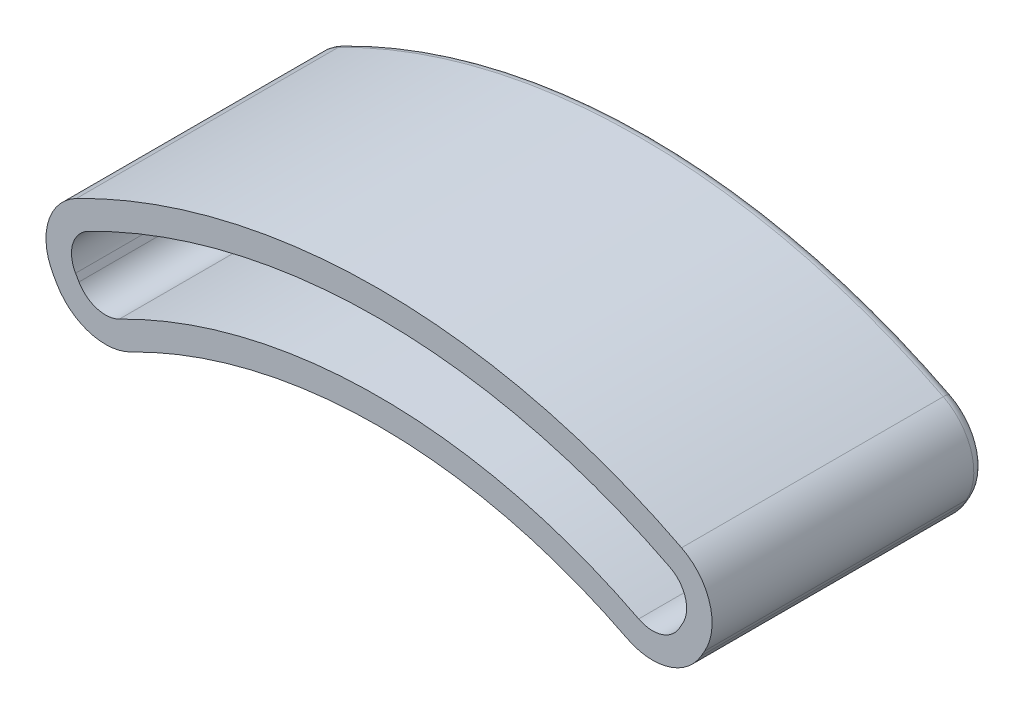
ISO-10303-21;
HEADER;
FILE_DESCRIPTION(('STEP AP214'),'2;1');
FILE_NAME('part.step','',(''),(''),'','','');
FILE_SCHEMA(('AUTOMOTIVE_DESIGN { 1 0 10303 214 1 1 1 1 }'));
ENDSEC;
DATA;
#1=APPLICATION_CONTEXT('core data for automotive mechanical design processes');
#2=APPLICATION_PROTOCOL_DEFINITION('international standard','automotive_design',2000,#1);
#3=PRODUCT_CONTEXT('',#1,'mechanical');
#4=PRODUCT('Part','Part','',(#3));
#5=PRODUCT_RELATED_PRODUCT_CATEGORY('part','',(#4));
#6=PRODUCT_DEFINITION_FORMATION('','',#4);
#7=PRODUCT_DEFINITION_CONTEXT('part definition',#1,'design');
#8=PRODUCT_DEFINITION('design','',#6,#7);
#9=PRODUCT_DEFINITION_SHAPE('','',#8);
#10=(LENGTH_UNIT() NAMED_UNIT(*) SI_UNIT(.MILLI.,.METRE.));
#11=(NAMED_UNIT(*) PLANE_ANGLE_UNIT() SI_UNIT($,.RADIAN.));
#12=(NAMED_UNIT(*) SI_UNIT($,.STERADIAN.) SOLID_ANGLE_UNIT());
#13=UNCERTAINTY_MEASURE_WITH_UNIT(LENGTH_MEASURE(1.E-05),#10,'distance_accuracy_value','');
#14=(GEOMETRIC_REPRESENTATION_CONTEXT(3) GLOBAL_UNCERTAINTY_ASSIGNED_CONTEXT((#13)) GLOBAL_UNIT_ASSIGNED_CONTEXT((#10,
#11,#12)) REPRESENTATION_CONTEXT('',''));
#15=CARTESIAN_POINT('',(0.,0.,0.));
#16=DIRECTION('',(0.,0.,1.));
#17=DIRECTION('',(1.,0.,0.));
#18=AXIS2_PLACEMENT_3D('',#15,#16,#17);
#19=CARTESIAN_POINT('',(-20.4441540822175,39.9823135881673,20.32));
#20=DIRECTION('',(0.,0.,1.));
#21=DIRECTION('',(1.,0.,0.));
#22=AXIS2_PLACEMENT_3D('',#19,#20,#21);
#23=PLANE('',#22);
#24=CARTESIAN_POINT('',(-20.4441540822175,39.9823135881673,20.32));
#25=DIRECTION('',(0.,0.,1.));
#26=DIRECTION('',(1.,0.,0.));
#27=AXIS2_PLACEMENT_3D('',#24,#25,#26);
#28=CIRCLE('',#27,4.191);
#29=CARTESIAN_POINT('',(-24.0736665494781,37.8868135881673,20.32));
#30=VERTEX_POINT('',#29);
#31=CARTESIAN_POINT('',(-18.536136228065,36.2508328005663,20.32));
#32=VERTEX_POINT('',#31);
#33=EDGE_CURVE('E271',#30,#32,#28,.T.);
#34=ORIENTED_EDGE('',*,*,#33,.T.);
#35=CARTESIAN_POINT('',(0.,0.,20.32));
#36=DIRECTION('',(0.,0.,1.));
#37=DIRECTION('',(1.,0.,0.));
#38=AXIS2_PLACEMENT_3D('',#35,#36,#37);
#39=CIRCLE('',#38,40.715);
#40=CARTESIAN_POINT('',(18.536136228065,36.2508328005663,20.32));
#41=VERTEX_POINT('',#40);
#42=EDGE_CURVE('E310',#32,#41,#39,.F.);
#43=ORIENTED_EDGE('',*,*,#42,.T.);
#44=CARTESIAN_POINT('',(20.4441540822175,39.9823135881673,20.32));
#45=DIRECTION('',(0.,0.,1.));
#46=DIRECTION('',(1.,0.,0.));
#47=AXIS2_PLACEMENT_3D('',#44,#45,#46);
#48=CIRCLE('',#47,4.191);
#49=CARTESIAN_POINT('',(24.0736665494781,37.8868135881673,20.32));
#50=VERTEX_POINT('',#49);
#51=EDGE_CURVE('E312',#41,#50,#48,.T.);
#52=ORIENTED_EDGE('',*,*,#51,.T.);
#53=DIRECTION('',(0.499999999999999,0.866025403784439,0.));
#54=VECTOR('',#53,1.);
#55=CARTESIAN_POINT('',(24.0736665494781,37.8868135881673,20.32));
#56=LINE('',#55,#54);
#57=CARTESIAN_POINT('',(24.3279926096189,38.3273192460199,20.32));
#58=VERTEX_POINT('',#57);
#59=EDGE_CURVE('E314',#50,#58,#56,.T.);
#60=ORIENTED_EDGE('',*,*,#59,.T.);
#61=CARTESIAN_POINT('',(20.6984801423583,40.4228192460199,20.32));
#62=DIRECTION('',(0.,0.,1.));
#63=DIRECTION('',(1.,0.,0.));
#64=AXIS2_PLACEMENT_3D('',#61,#62,#63);
#65=CIRCLE('',#64,4.191);
#66=CARTESIAN_POINT('',(22.6086252578871,44.1532115360642,20.32));
#67=VERTEX_POINT('',#66);
#68=EDGE_CURVE('E316',#58,#67,#65,.T.);
#69=ORIENTED_EDGE('',*,*,#68,.T.);
#70=CARTESIAN_POINT('',(0.,0.,20.32));
#71=DIRECTION('',(0.,0.,1.));
#72=DIRECTION('',(1.,0.,0.));
#73=AXIS2_PLACEMENT_3D('',#70,#71,#72);
#74=CIRCLE('',#73,49.605);
#75=CARTESIAN_POINT('',(-22.6086252578871,44.1532115360642,20.32));
#76=VERTEX_POINT('',#75);
#77=EDGE_CURVE('E318',#67,#76,#74,.T.);
#78=ORIENTED_EDGE('',*,*,#77,.T.);
#79=CARTESIAN_POINT('',(-20.6984801423583,40.4228192460199,20.32));
#80=DIRECTION('',(0.,0.,1.));
#81=DIRECTION('',(1.,0.,0.));
#82=AXIS2_PLACEMENT_3D('',#79,#80,#81);
#83=CIRCLE('',#82,4.19100000000001);
#84=CARTESIAN_POINT('',(-24.3279926096189,38.3273192460199,20.32));
#85=VERTEX_POINT('',#84);
#86=EDGE_CURVE('E320',#76,#85,#83,.T.);
#87=ORIENTED_EDGE('',*,*,#86,.T.);
#88=DIRECTION('',(0.5,-0.866025403784439,0.));
#89=VECTOR('',#88,1.);
#90=CARTESIAN_POINT('',(-24.0736665494781,37.8868135881673,20.32));
#91=LINE('',#90,#89);
#92=EDGE_CURVE('E322',#85,#30,#91,.T.);
#93=ORIENTED_EDGE('',*,*,#92,.T.);
#94=EDGE_LOOP('',(#34,#43,#52,#60,#69,#78,#87,#93));
#95=FACE_BOUND('',#94,.T.);
#96=CARTESIAN_POINT('',(0.,0.,20.32));
#97=DIRECTION('',(0.,0.,-1.));
#98=DIRECTION('',(1.,0.,0.));
#99=AXIS2_PLACEMENT_3D('',#96,#97,#98);
#100=CIRCLE('',#99,42.62);
#101=CARTESIAN_POINT('',(-19.4034170708616,37.9469604312941,20.32));
#102=VERTEX_POINT('',#101);
#103=CARTESIAN_POINT('',(19.4034170708616,37.9469604312941,20.32));
#104=VERTEX_POINT('',#103);
#105=EDGE_CURVE('E262',#102,#104,#100,.T.);
#106=ORIENTED_EDGE('',*,*,#105,.F.);
#107=CARTESIAN_POINT('',(-20.4441540822175,39.9823135881673,20.32));
#108=DIRECTION('',(0.,0.,1.));
#109=DIRECTION('',(1.,0.,0.));
#110=AXIS2_PLACEMENT_3D('',#107,#108,#109);
#111=CIRCLE('',#110,2.286);
#112=CARTESIAN_POINT('',(-22.4238881552688,38.8393135881673,20.32));
#113=VERTEX_POINT('',#112);
#114=EDGE_CURVE('E252',#113,#102,#111,.T.);
#115=ORIENTED_EDGE('',*,*,#114,.F.);
#116=DIRECTION('',(0.5,-0.866025403784439,0.));
#117=VECTOR('',#116,1.);
#118=CARTESIAN_POINT('',(-22.4238881552688,38.8393135881673,20.32));
#119=LINE('',#118,#117);
#120=CARTESIAN_POINT('',(-22.6782142154095,39.2798192460199,20.32));
#121=VERTEX_POINT('',#120);
#122=EDGE_CURVE('E289',#121,#113,#119,.T.);
#123=ORIENTED_EDGE('',*,*,#122,.F.);
#124=CARTESIAN_POINT('',(-20.6984801423583,40.4228192460199,20.32));
#125=DIRECTION('',(0.,0.,1.));
#126=DIRECTION('',(-1.,0.,0.));
#127=AXIS2_PLACEMENT_3D('',#124,#125,#126);
#128=CIRCLE('',#127,2.28600000000001);
#129=CARTESIAN_POINT('',(-21.7403774781013,42.4575786769532,20.32));
#130=VERTEX_POINT('',#129);
#131=EDGE_CURVE('E286',#130,#121,#128,.T.);
#132=ORIENTED_EDGE('',*,*,#131,.F.);
#133=CARTESIAN_POINT('',(0.,0.,20.32));
#134=DIRECTION('',(0.,0.,1.));
#135=DIRECTION('',(1.,0.,0.));
#136=AXIS2_PLACEMENT_3D('',#133,#134,#135);
#137=CIRCLE('',#136,47.7);
#138=CARTESIAN_POINT('',(21.7403774781013,42.4575786769532,20.32));
#139=VERTEX_POINT('',#138);
#140=EDGE_CURVE('E284',#139,#130,#137,.T.);
#141=ORIENTED_EDGE('',*,*,#140,.F.);
#142=CARTESIAN_POINT('',(20.6984801423583,40.4228192460199,20.32));
#143=DIRECTION('',(0.,0.,1.));
#144=DIRECTION('',(1.,0.,0.));
#145=AXIS2_PLACEMENT_3D('',#142,#143,#144);
#146=CIRCLE('',#145,2.286);
#147=CARTESIAN_POINT('',(22.6782142154095,39.2798192460199,20.32));
#148=VERTEX_POINT('',#147);
#149=EDGE_CURVE('E282',#148,#139,#146,.T.);
#150=ORIENTED_EDGE('',*,*,#149,.F.);
#151=DIRECTION('',(0.499999999999999,0.866025403784439,0.));
#152=VECTOR('',#151,1.);
#153=CARTESIAN_POINT('',(22.4238881552687,38.8393135881673,20.32));
#154=LINE('',#153,#152);
#155=CARTESIAN_POINT('',(22.4238881552687,38.8393135881673,20.32));
#156=VERTEX_POINT('',#155);
#157=EDGE_CURVE('E278',#156,#148,#154,.T.);
#158=ORIENTED_EDGE('',*,*,#157,.F.);
#159=CARTESIAN_POINT('',(20.4441540822175,39.9823135881673,20.32));
#160=DIRECTION('',(0.,0.,1.));
#161=DIRECTION('',(-1.,0.,0.));
#162=AXIS2_PLACEMENT_3D('',#159,#160,#161);
#163=CIRCLE('',#162,2.286);
#164=EDGE_CURVE('E276',#104,#156,#163,.T.);
#165=ORIENTED_EDGE('',*,*,#164,.F.);
#166=EDGE_LOOP('',(#106,#115,#123,#132,#141,#150,#158,#165));
#167=FACE_BOUND('',#166,.T.);
#168=ADVANCED_FACE('F87',(#95,#167),#23,.T.);
#169=CARTESIAN_POINT('',(-20.4441540822175,39.9823135881673,0.));
#170=DIRECTION('',(0.,0.,1.));
#171=DIRECTION('',(1.,0.,0.));
#172=AXIS2_PLACEMENT_3D('',#169,#170,#171);
#173=PLANE('',#172);
#174=DIRECTION('',(0.499999999999999,0.866025403784439,0.));
#175=VECTOR('',#174,1.);
#176=CARTESIAN_POINT('',(23.3381255730933,38.8988192460199,0.));
#177=LINE('',#176,#175);
#178=CARTESIAN_POINT('',(23.0837995129525,38.4583135881673,0.));
#179=VERTEX_POINT('',#178);
#180=CARTESIAN_POINT('',(23.3381255730933,38.8988192460199,0.));
#181=VERTEX_POINT('',#180);
#182=EDGE_CURVE('E374',#179,#181,#177,.T.);
#183=ORIENTED_EDGE('',*,*,#182,.T.);
#184=CARTESIAN_POINT('',(20.6984801423583,40.4228192460199,0.));
#185=DIRECTION('',(0.,0.,1.));
#186=DIRECTION('',(1.,0.,0.));
#187=AXIS2_PLACEMENT_3D('',#184,#185,#186);
#188=CIRCLE('',#187,3.048);
#189=CARTESIAN_POINT('',(22.0876765900156,43.1358318205976,0.));
#190=VERTEX_POINT('',#189);
#191=EDGE_CURVE('E376',#181,#190,#188,.T.);
#192=ORIENTED_EDGE('',*,*,#191,.T.);
#193=CARTESIAN_POINT('',(0.,0.,0.));
#194=DIRECTION('',(0.,0.,1.));
#195=DIRECTION('',(1.,0.,0.));
#196=AXIS2_PLACEMENT_3D('',#193,#194,#195);
#197=CIRCLE('',#196,48.462);
#198=CARTESIAN_POINT('',(-22.0876765900156,43.1358318205976,0.));
#199=VERTEX_POINT('',#198);
#200=EDGE_CURVE('E362',#190,#199,#197,.T.);
#201=ORIENTED_EDGE('',*,*,#200,.T.);
#202=CARTESIAN_POINT('',(-20.6984801423583,40.4228192460199,0.));
#203=DIRECTION('',(0.,0.,1.));
#204=DIRECTION('',(1.,0.,0.));
#205=AXIS2_PLACEMENT_3D('',#202,#203,#204);
#206=CIRCLE('',#205,3.04800000000001);
#207=CARTESIAN_POINT('',(-23.3381255730933,38.8988192460199,0.));
#208=VERTEX_POINT('',#207);
#209=EDGE_CURVE('E364',#199,#208,#206,.T.);
#210=ORIENTED_EDGE('',*,*,#209,.T.);
#211=DIRECTION('',(0.5,-0.866025403784439,0.));
#212=VECTOR('',#211,1.);
#213=CARTESIAN_POINT('',(-23.0837995129525,38.4583135881673,0.));
#214=LINE('',#213,#212);
#215=CARTESIAN_POINT('',(-23.0837995129525,38.4583135881673,0.));
#216=VERTEX_POINT('',#215);
#217=EDGE_CURVE('E366',#208,#216,#214,.T.);
#218=ORIENTED_EDGE('',*,*,#217,.T.);
#219=CARTESIAN_POINT('',(-20.4441540822175,39.9823135881673,0.));
#220=DIRECTION('',(0.,0.,1.));
#221=DIRECTION('',(1.,0.,0.));
#222=AXIS2_PLACEMENT_3D('',#219,#220,#221);
#223=CIRCLE('',#222,3.048);
#224=CARTESIAN_POINT('',(-19.056504733743,37.268509379003,0.));
#225=VERTEX_POINT('',#224);
#226=EDGE_CURVE('E368',#216,#225,#223,.T.);
#227=ORIENTED_EDGE('',*,*,#226,.T.);
#228=CARTESIAN_POINT('',(0.,0.,0.));
#229=DIRECTION('',(0.,0.,1.));
#230=DIRECTION('',(1.,0.,0.));
#231=AXIS2_PLACEMENT_3D('',#228,#229,#230);
#232=CIRCLE('',#231,41.858);
#233=CARTESIAN_POINT('',(19.056504733743,37.268509379003,0.));
#234=VERTEX_POINT('',#233);
#235=EDGE_CURVE('E370',#225,#234,#232,.F.);
#236=ORIENTED_EDGE('',*,*,#235,.T.);
#237=CARTESIAN_POINT('',(20.4441540822175,39.9823135881673,0.));
#238=DIRECTION('',(0.,0.,1.));
#239=DIRECTION('',(1.,0.,0.));
#240=AXIS2_PLACEMENT_3D('',#237,#238,#239);
#241=CIRCLE('',#240,3.048);
#242=EDGE_CURVE('E372',#234,#179,#241,.T.);
#243=ORIENTED_EDGE('',*,*,#242,.T.);
#244=EDGE_LOOP('',(#183,#192,#201,#210,#218,#227,#236,#243));
#245=FACE_BOUND('',#244,.T.);
#246=CARTESIAN_POINT('',(0.,0.,0.));
#247=DIRECTION('',(0.,0.,1.));
#248=DIRECTION('',(1.,0.,0.));
#249=AXIS2_PLACEMENT_3D('',#246,#247,#248);
#250=CIRCLE('',#249,48.843);
#251=CARTESIAN_POINT('',(-22.2613261459727,43.4749583924198,0.));
#252=VERTEX_POINT('',#251);
#253=CARTESIAN_POINT('',(22.2613261459727,43.4749583924198,0.));
#254=VERTEX_POINT('',#253);
#255=EDGE_CURVE('E345',#252,#254,#250,.F.);
#256=ORIENTED_EDGE('',*,*,#255,.T.);
#257=CARTESIAN_POINT('',(20.6984801423583,40.4228192460199,0.));
#258=DIRECTION('',(0.,0.,1.));
#259=DIRECTION('',(1.,0.,0.));
#260=AXIS2_PLACEMENT_3D('',#257,#258,#259);
#261=CIRCLE('',#260,3.429);
#262=CARTESIAN_POINT('',(23.6680812519351,38.7083192460199,0.));
#263=VERTEX_POINT('',#262);
#264=EDGE_CURVE('E359',#254,#263,#261,.F.);
#265=ORIENTED_EDGE('',*,*,#264,.T.);
#266=DIRECTION('',(0.499999999999999,0.866025403784439,0.));
#267=VECTOR('',#266,1.);
#268=CARTESIAN_POINT('',(13.1916781506856,20.5626567940836,0.));
#269=LINE('',#268,#267);
#270=CARTESIAN_POINT('',(23.4137551917944,38.2678135881673,0.));
#271=VERTEX_POINT('',#270);
#272=EDGE_CURVE('E357',#263,#271,#269,.F.);
#273=ORIENTED_EDGE('',*,*,#272,.T.);
#274=CARTESIAN_POINT('',(20.4441540822175,39.9823135881673,0.));
#275=DIRECTION('',(0.,0.,1.));
#276=DIRECTION('',(1.,0.,0.));
#277=AXIS2_PLACEMENT_3D('',#274,#275,#276);
#278=CIRCLE('',#277,3.429);
#279=CARTESIAN_POINT('',(18.8830485651836,36.9292838528574,0.));
#280=VERTEX_POINT('',#279);
#281=EDGE_CURVE('E355',#271,#280,#278,.F.);
#282=ORIENTED_EDGE('',*,*,#281,.T.);
#283=CARTESIAN_POINT('',(0.,0.,0.));
#284=DIRECTION('',(0.,0.,1.));
#285=DIRECTION('',(1.,0.,0.));
#286=AXIS2_PLACEMENT_3D('',#283,#284,#285);
#287=CIRCLE('',#286,41.477);
#288=CARTESIAN_POINT('',(-18.8830485651836,36.9292838528574,0.));
#289=VERTEX_POINT('',#288);
#290=EDGE_CURVE('E353',#280,#289,#287,.T.);
#291=ORIENTED_EDGE('',*,*,#290,.T.);
#292=CARTESIAN_POINT('',(-20.4441540822175,39.9823135881673,0.));
#293=DIRECTION('',(0.,0.,1.));
#294=DIRECTION('',(1.,0.,0.));
#295=AXIS2_PLACEMENT_3D('',#292,#293,#294);
#296=CIRCLE('',#295,3.429);
#297=CARTESIAN_POINT('',(-23.4137551917944,38.2678135881673,0.));
#298=VERTEX_POINT('',#297);
#299=EDGE_CURVE('E351',#289,#298,#296,.F.);
#300=ORIENTED_EDGE('',*,*,#299,.T.);
#301=DIRECTION('',(0.5,-0.866025403784439,0.));
#302=VECTOR('',#301,1.);
#303=CARTESIAN_POINT('',(-23.4137551917944,38.2678135881673,0.));
#304=LINE('',#303,#302);
#305=CARTESIAN_POINT('',(-23.6680812519351,38.7083192460199,0.));
#306=VERTEX_POINT('',#305);
#307=EDGE_CURVE('E349',#298,#306,#304,.F.);
#308=ORIENTED_EDGE('',*,*,#307,.T.);
#309=CARTESIAN_POINT('',(-20.6984801423583,40.4228192460199,0.));
#310=DIRECTION('',(0.,0.,1.));
#311=DIRECTION('',(1.,0.,0.));
#312=AXIS2_PLACEMENT_3D('',#309,#310,#311);
#313=CIRCLE('',#312,3.42900000000001);
#314=EDGE_CURVE('E347',#306,#252,#313,.F.);
#315=ORIENTED_EDGE('',*,*,#314,.T.);
#316=EDGE_LOOP('',(#256,#265,#273,#282,#291,#300,#308,#315));
#317=FACE_BOUND('',#316,.T.);
#318=ADVANCED_FACE('F461',(#245,#317),#173,.F.);
#319=CARTESIAN_POINT('',(-20.4441540822175,39.9823135881673,20.32));
#320=DIRECTION('',(0.,0.,-1.));
#321=DIRECTION('',(-1.,0.,0.));
#322=AXIS2_PLACEMENT_3D('',#319,#320,#321);
#323=CYLINDRICAL_SURFACE('',#322,4.191);
#324=DIRECTION('',(0.,0.,-1.));
#325=VECTOR('',#324,1.);
#326=CARTESIAN_POINT('',(-24.0736665494781,37.8868135881673,20.32));
#327=LINE('',#326,#325);
#328=CARTESIAN_POINT('',(-24.0736665494781,37.8868135881673,0.761999999999999));
#329=VERTEX_POINT('',#328);
#330=EDGE_CURVE('E324',#30,#329,#327,.T.);
#331=ORIENTED_EDGE('',*,*,#330,.T.);
#332=CARTESIAN_POINT('',(-20.4441540822175,39.9823135881673,0.761999999999999));
#333=DIRECTION('',(0.,0.,1.));
#334=DIRECTION('',(1.,0.,0.));
#335=AXIS2_PLACEMENT_3D('',#332,#333,#334);
#336=CIRCLE('',#335,4.191);
#337=CARTESIAN_POINT('',(-18.536136228065,36.2508328005663,0.761999999999999));
#338=VERTEX_POINT('',#337);
#339=EDGE_CURVE('E402',#329,#338,#336,.T.);
#340=ORIENTED_EDGE('',*,*,#339,.T.);
#341=DIRECTION('',(0.,0.,-1.));
#342=VECTOR('',#341,1.);
#343=CARTESIAN_POINT('',(-18.536136228065,36.2508328005663,20.32));
#344=LINE('',#343,#342);
#345=EDGE_CURVE('E342',#32,#338,#344,.T.);
#346=ORIENTED_EDGE('',*,*,#345,.F.);
#347=ORIENTED_EDGE('',*,*,#33,.F.);
#348=EDGE_LOOP('',(#331,#340,#346,#347));
#349=FACE_BOUND('',#348,.T.);
#350=ADVANCED_FACE('F494',(#349),#323,.T.);
#351=CARTESIAN_POINT('',(0.,0.,20.32));
#352=DIRECTION('',(0.,0.,-1.));
#353=DIRECTION('',(-1.,0.,0.));
#354=AXIS2_PLACEMENT_3D('',#351,#352,#353);
#355=CYLINDRICAL_SURFACE('',#354,40.715);
#356=ORIENTED_EDGE('',*,*,#345,.T.);
#357=CARTESIAN_POINT('',(0.,0.,0.761999999999999));
#358=DIRECTION('',(0.,0.,1.));
#359=DIRECTION('',(1.,0.,0.));
#360=AXIS2_PLACEMENT_3D('',#357,#358,#359);
#361=CIRCLE('',#360,40.715);
#362=CARTESIAN_POINT('',(18.536136228065,36.2508328005663,0.761999999999999));
#363=VERTEX_POINT('',#362);
#364=EDGE_CURVE('E400',#338,#363,#361,.F.);
#365=ORIENTED_EDGE('',*,*,#364,.T.);
#366=DIRECTION('',(0.,0.,-1.));
#367=VECTOR('',#366,1.);
#368=CARTESIAN_POINT('',(18.536136228065,36.2508328005663,20.32));
#369=LINE('',#368,#367);
#370=EDGE_CURVE('E339',#41,#363,#369,.T.);
#371=ORIENTED_EDGE('',*,*,#370,.F.);
#372=ORIENTED_EDGE('',*,*,#42,.F.);
#373=EDGE_LOOP('',(#356,#365,#371,#372));
#374=FACE_BOUND('',#373,.T.);
#375=ADVANCED_FACE('F490',(#374),#355,.F.);
#376=CARTESIAN_POINT('',(20.4441540822175,39.9823135881673,20.32));
#377=DIRECTION('',(0.,0.,-1.));
#378=DIRECTION('',(-1.,0.,0.));
#379=AXIS2_PLACEMENT_3D('',#376,#377,#378);
#380=CYLINDRICAL_SURFACE('',#379,4.191);
#381=ORIENTED_EDGE('',*,*,#370,.T.);
#382=CARTESIAN_POINT('',(20.4441540822175,39.9823135881673,0.761999999999999));
#383=DIRECTION('',(0.,0.,1.));
#384=DIRECTION('',(1.,0.,0.));
#385=AXIS2_PLACEMENT_3D('',#382,#383,#384);
#386=CIRCLE('',#385,4.191);
#387=CARTESIAN_POINT('',(24.0736665494781,37.8868135881673,0.761999999999999));
#388=VERTEX_POINT('',#387);
#389=EDGE_CURVE('E398',#363,#388,#386,.T.);
#390=ORIENTED_EDGE('',*,*,#389,.T.);
#391=DIRECTION('',(0.,0.,-1.));
#392=VECTOR('',#391,1.);
#393=CARTESIAN_POINT('',(24.0736665494781,37.8868135881673,20.32));
#394=LINE('',#393,#392);
#395=EDGE_CURVE('E336',#50,#388,#394,.T.);
#396=ORIENTED_EDGE('',*,*,#395,.F.);
#397=ORIENTED_EDGE('',*,*,#51,.F.);
#398=EDGE_LOOP('',(#381,#390,#396,#397));
#399=FACE_BOUND('',#398,.T.);
#400=ADVANCED_FACE('F488',(#399),#380,.T.);
#401=CARTESIAN_POINT('',(24.0736665494781,37.8868135881673,20.32));
#402=DIRECTION('',(-0.866025403784439,0.499999999999999,0.));
#403=DIRECTION('',(-0.499999999999999,-0.866025403784439,0.));
#404=AXIS2_PLACEMENT_3D('',#401,#402,#403);
#405=PLANE('',#404);
#406=ORIENTED_EDGE('',*,*,#395,.T.);
#407=DIRECTION('',(0.499999999999999,0.866025403784439,0.));
#408=VECTOR('',#407,1.);
#409=CARTESIAN_POINT('',(24.0736665494781,37.8868135881673,0.761999999999999));
#410=LINE('',#409,#408);
#411=CARTESIAN_POINT('',(24.3279926096189,38.3273192460199,0.761999999999999));
#412=VERTEX_POINT('',#411);
#413=EDGE_CURVE('E396',#388,#412,#410,.T.);
#414=ORIENTED_EDGE('',*,*,#413,.T.);
#415=DIRECTION('',(0.,0.,-1.));
#416=VECTOR('',#415,1.);
#417=CARTESIAN_POINT('',(24.3279926096189,38.3273192460199,20.32));
#418=LINE('',#417,#416);
#419=EDGE_CURVE('E333',#58,#412,#418,.T.);
#420=ORIENTED_EDGE('',*,*,#419,.F.);
#421=ORIENTED_EDGE('',*,*,#59,.F.);
#422=EDGE_LOOP('',(#406,#414,#420,#421));
#423=FACE_BOUND('',#422,.T.);
#424=ADVANCED_FACE('F476',(#423),#405,.F.);
#425=CARTESIAN_POINT('',(20.6984801423583,40.4228192460199,20.32));
#426=DIRECTION('',(0.,0.,-1.));
#427=DIRECTION('',(-1.,0.,0.));
#428=AXIS2_PLACEMENT_3D('',#425,#426,#427);
#429=CYLINDRICAL_SURFACE('',#428,4.191);
#430=ORIENTED_EDGE('',*,*,#419,.T.);
#431=CARTESIAN_POINT('',(20.6984801423583,40.4228192460199,0.761999999999999));
#432=DIRECTION('',(0.,0.,1.));
#433=DIRECTION('',(1.,0.,0.));
#434=AXIS2_PLACEMENT_3D('',#431,#432,#433);
#435=CIRCLE('',#434,4.191);
#436=CARTESIAN_POINT('',(22.6086252578871,44.1532115360642,0.761999999999999));
#437=VERTEX_POINT('',#436);
#438=EDGE_CURVE('E393',#412,#437,#435,.T.);
#439=ORIENTED_EDGE('',*,*,#438,.T.);
#440=DIRECTION('',(0.,0.,-1.));
#441=VECTOR('',#440,1.);
#442=CARTESIAN_POINT('',(22.6086252578871,44.1532115360642,20.32));
#443=LINE('',#442,#441);
#444=EDGE_CURVE('E331',#67,#437,#443,.T.);
#445=ORIENTED_EDGE('',*,*,#444,.F.);
#446=ORIENTED_EDGE('',*,*,#68,.F.);
#447=EDGE_LOOP('',(#430,#439,#445,#446));
#448=FACE_BOUND('',#447,.T.);
#449=ADVANCED_FACE('F481',(#448),#429,.T.);
#450=CARTESIAN_POINT('',(0.,0.,20.32));
#451=DIRECTION('',(0.,0.,-1.));
#452=DIRECTION('',(-1.,0.,0.));
#453=AXIS2_PLACEMENT_3D('',#450,#451,#452);
#454=CYLINDRICAL_SURFACE('',#453,49.605);
#455=ORIENTED_EDGE('',*,*,#444,.T.);
#456=CARTESIAN_POINT('',(0.,0.,0.761999999999999));
#457=DIRECTION('',(0.,0.,1.));
#458=DIRECTION('',(1.,0.,0.));
#459=AXIS2_PLACEMENT_3D('',#456,#457,#458);
#460=CIRCLE('',#459,49.605);
#461=CARTESIAN_POINT('',(-22.6086252578871,44.1532115360642,0.761999999999999));
#462=VERTEX_POINT('',#461);
#463=EDGE_CURVE('E12',#437,#462,#460,.T.);
#464=ORIENTED_EDGE('',*,*,#463,.T.);
#465=DIRECTION('',(0.,0.,-1.));
#466=VECTOR('',#465,1.);
#467=CARTESIAN_POINT('',(-22.6086252578871,44.1532115360642,20.32));
#468=LINE('',#467,#466);
#469=EDGE_CURVE('E329',#76,#462,#468,.T.);
#470=ORIENTED_EDGE('',*,*,#469,.F.);
#471=ORIENTED_EDGE('',*,*,#77,.F.);
#472=EDGE_LOOP('',(#455,#464,#470,#471));
#473=FACE_BOUND('',#472,.T.);
#474=ADVANCED_FACE('F534',(#473),#454,.T.);
#475=CARTESIAN_POINT('',(-20.6984801423583,40.4228192460199,20.32));
#476=DIRECTION('',(0.,0.,-1.));
#477=DIRECTION('',(-1.,0.,0.));
#478=AXIS2_PLACEMENT_3D('',#475,#476,#477);
#479=CYLINDRICAL_SURFACE('',#478,4.19100000000001);
#480=ORIENTED_EDGE('',*,*,#469,.T.);
#481=CARTESIAN_POINT('',(-20.6984801423583,40.4228192460199,0.761999999999999));
#482=DIRECTION('',(0.,0.,1.));
#483=DIRECTION('',(1.,0.,0.));
#484=AXIS2_PLACEMENT_3D('',#481,#482,#483);
#485=CIRCLE('',#484,4.19100000000001);
#486=CARTESIAN_POINT('',(-24.3279926096189,38.3273192460199,0.761999999999999));
#487=VERTEX_POINT('',#486);
#488=EDGE_CURVE('E109',#462,#487,#485,.T.);
#489=ORIENTED_EDGE('',*,*,#488,.T.);
#490=DIRECTION('',(0.,0.,-1.));
#491=VECTOR('',#490,1.);
#492=CARTESIAN_POINT('',(-24.3279926096189,38.3273192460199,20.32));
#493=LINE('',#492,#491);
#494=EDGE_CURVE('E327',#85,#487,#493,.T.);
#495=ORIENTED_EDGE('',*,*,#494,.F.);
#496=ORIENTED_EDGE('',*,*,#86,.F.);
#497=EDGE_LOOP('',(#480,#489,#495,#496));
#498=FACE_BOUND('',#497,.T.);
#499=ADVANCED_FACE('F531',(#498),#479,.T.);
#500=CARTESIAN_POINT('',(-24.0736665494781,37.8868135881673,20.32));
#501=DIRECTION('',(0.866025403784439,0.5,0.));
#502=DIRECTION('',(-0.5,0.866025403784439,0.));
#503=AXIS2_PLACEMENT_3D('',#500,#501,#502);
#504=PLANE('',#503);
#505=ORIENTED_EDGE('',*,*,#494,.T.);
#506=DIRECTION('',(0.5,-0.866025403784439,0.));
#507=VECTOR('',#506,1.);
#508=CARTESIAN_POINT('',(-24.0736665494781,37.8868135881673,0.761999999999999));
#509=LINE('',#508,#507);
#510=EDGE_CURVE('E404',#487,#329,#509,.T.);
#511=ORIENTED_EDGE('',*,*,#510,.T.);
#512=ORIENTED_EDGE('',*,*,#330,.F.);
#513=ORIENTED_EDGE('',*,*,#92,.F.);
#514=EDGE_LOOP('',(#505,#511,#512,#513));
#515=FACE_BOUND('',#514,.T.);
#516=ADVANCED_FACE('F498',(#515),#504,.F.);
#517=CARTESIAN_POINT('',(-20.4441540822175,39.9823135881673,20.32));
#518=DIRECTION('',(0.,0.,-1.));
#519=DIRECTION('',(-1.,0.,0.));
#520=AXIS2_PLACEMENT_3D('',#517,#518,#519);
#521=CYLINDRICAL_SURFACE('',#520,2.286);
#522=DIRECTION('',(0.,0.,-1.));
#523=VECTOR('',#522,1.);
#524=CARTESIAN_POINT('',(-19.4034170708616,37.9469604312941,20.32));
#525=LINE('',#524,#523);
#526=CARTESIAN_POINT('',(-19.4034170708616,37.9469604312941,0.761999999999999));
#527=VERTEX_POINT('',#526);
#528=EDGE_CURVE('E255',#102,#527,#525,.T.);
#529=ORIENTED_EDGE('',*,*,#528,.T.);
#530=CARTESIAN_POINT('',(-20.4441540822175,39.9823135881673,0.761999999999999));
#531=DIRECTION('',(0.,0.,1.));
#532=DIRECTION('',(1.,0.,0.));
#533=AXIS2_PLACEMENT_3D('',#530,#531,#532);
#534=CIRCLE('',#533,2.286);
#535=CARTESIAN_POINT('',(-22.4238881552688,38.8393135881673,0.761999999999999));
#536=VERTEX_POINT('',#535);
#537=EDGE_CURVE('E387',#527,#536,#534,.F.);
#538=ORIENTED_EDGE('',*,*,#537,.T.);
#539=DIRECTION('',(0.,0.,-1.));
#540=VECTOR('',#539,1.);
#541=CARTESIAN_POINT('',(-22.4238881552688,38.8393135881673,20.32));
#542=LINE('',#541,#540);
#543=EDGE_CURVE('E258',#113,#536,#542,.T.);
#544=ORIENTED_EDGE('',*,*,#543,.F.);
#545=ORIENTED_EDGE('',*,*,#114,.T.);
#546=EDGE_LOOP('',(#529,#538,#544,#545));
#547=FACE_BOUND('',#546,.T.);
#548=ADVANCED_FACE('F254',(#547),#521,.F.);
#549=CARTESIAN_POINT('',(0.,0.,20.32));
#550=DIRECTION('',(0.,0.,-1.));
#551=DIRECTION('',(-1.,0.,0.));
#552=AXIS2_PLACEMENT_3D('',#549,#550,#551);
#553=CYLINDRICAL_SURFACE('',#552,42.62);
#554=DIRECTION('',(0.,0.,-1.));
#555=VECTOR('',#554,1.);
#556=CARTESIAN_POINT('',(19.4034170708616,37.9469604312941,20.32));
#557=LINE('',#556,#555);
#558=CARTESIAN_POINT('',(19.4034170708616,37.9469604312941,0.761999999999999));
#559=VERTEX_POINT('',#558);
#560=EDGE_CURVE('E272',#104,#559,#557,.T.);
#561=ORIENTED_EDGE('',*,*,#560,.T.);
#562=CARTESIAN_POINT('',(0.,0.,0.761999999999999));
#563=DIRECTION('',(0.,0.,1.));
#564=DIRECTION('',(1.,0.,0.));
#565=AXIS2_PLACEMENT_3D('',#562,#563,#564);
#566=CIRCLE('',#565,42.62);
#567=EDGE_CURVE('E270',#559,#527,#566,.T.);
#568=ORIENTED_EDGE('',*,*,#567,.T.);
#569=ORIENTED_EDGE('',*,*,#528,.F.);
#570=ORIENTED_EDGE('',*,*,#105,.T.);
#571=EDGE_LOOP('',(#561,#568,#569,#570));
#572=FACE_BOUND('',#571,.T.);
#573=ADVANCED_FACE('F267',(#572),#553,.T.);
#574=CARTESIAN_POINT('',(20.4441540822175,39.9823135881673,20.32));
#575=DIRECTION('',(0.,0.,-1.));
#576=DIRECTION('',(-1.,0.,0.));
#577=AXIS2_PLACEMENT_3D('',#574,#575,#576);
#578=CYLINDRICAL_SURFACE('',#577,2.286);
#579=DIRECTION('',(0.,0.,-1.));
#580=VECTOR('',#579,1.);
#581=CARTESIAN_POINT('',(22.4238881552687,38.8393135881673,20.32));
#582=LINE('',#581,#580);
#583=CARTESIAN_POINT('',(22.4238881552687,38.8393135881673,0.761999999999999));
#584=VERTEX_POINT('',#583);
#585=EDGE_CURVE('E304',#156,#584,#582,.T.);
#586=ORIENTED_EDGE('',*,*,#585,.T.);
#587=CARTESIAN_POINT('',(20.4441540822175,39.9823135881673,0.761999999999999));
#588=DIRECTION('',(0.,0.,1.));
#589=DIRECTION('',(1.,0.,0.));
#590=AXIS2_PLACEMENT_3D('',#587,#588,#589);
#591=CIRCLE('',#590,2.286);
#592=EDGE_CURVE('E384',#584,#559,#591,.F.);
#593=ORIENTED_EDGE('',*,*,#592,.T.);
#594=ORIENTED_EDGE('',*,*,#560,.F.);
#595=ORIENTED_EDGE('',*,*,#164,.T.);
#596=EDGE_LOOP('',(#586,#593,#594,#595));
#597=FACE_BOUND('',#596,.T.);
#598=ADVANCED_FACE('F620',(#597),#578,.F.);
#599=CARTESIAN_POINT('',(22.4238881552687,38.8393135881673,20.32));
#600=DIRECTION('',(-0.866025403784439,0.499999999999999,0.));
#601=DIRECTION('',(-0.499999999999999,-0.866025403784439,0.));
#602=AXIS2_PLACEMENT_3D('',#599,#600,#601);
#603=PLANE('',#602);
#604=DIRECTION('',(0.,0.,-1.));
#605=VECTOR('',#604,1.);
#606=CARTESIAN_POINT('',(22.6782142154095,39.2798192460199,20.32));
#607=LINE('',#606,#605);
#608=CARTESIAN_POINT('',(22.6782142154095,39.2798192460199,0.761999999999999));
#609=VERTEX_POINT('',#608);
#610=EDGE_CURVE('E301',#148,#609,#607,.T.);
#611=ORIENTED_EDGE('',*,*,#610,.T.);
#612=DIRECTION('',(0.499999999999999,0.866025403784439,0.));
#613=VECTOR('',#612,1.);
#614=CARTESIAN_POINT('',(22.4238881552688,38.8393135881673,0.762));
#615=LINE('',#614,#613);
#616=EDGE_CURVE('E382',#609,#584,#615,.F.);
#617=ORIENTED_EDGE('',*,*,#616,.T.);
#618=ORIENTED_EDGE('',*,*,#585,.F.);
#619=ORIENTED_EDGE('',*,*,#157,.T.);
#620=EDGE_LOOP('',(#611,#617,#618,#619));
#621=FACE_BOUND('',#620,.T.);
#622=ADVANCED_FACE('F617',(#621),#603,.T.);
#623=CARTESIAN_POINT('',(20.6984801423583,40.4228192460199,20.32));
#624=DIRECTION('',(0.,0.,-1.));
#625=DIRECTION('',(-1.,0.,0.));
#626=AXIS2_PLACEMENT_3D('',#623,#624,#625);
#627=CYLINDRICAL_SURFACE('',#626,2.286);
#628=DIRECTION('',(0.,0.,-1.));
#629=VECTOR('',#628,1.);
#630=CARTESIAN_POINT('',(21.7403774781013,42.4575786769532,20.32));
#631=LINE('',#630,#629);
#632=CARTESIAN_POINT('',(21.7403774781013,42.4575786769532,0.761999999999999));
#633=VERTEX_POINT('',#632);
#634=EDGE_CURVE('E298',#139,#633,#631,.T.);
#635=ORIENTED_EDGE('',*,*,#634,.T.);
#636=CARTESIAN_POINT('',(20.6984801423583,40.4228192460199,0.761999999999999));
#637=DIRECTION('',(0.,0.,1.));
#638=DIRECTION('',(1.,0.,0.));
#639=AXIS2_PLACEMENT_3D('',#636,#637,#638);
#640=CIRCLE('',#639,2.286);
#641=EDGE_CURVE('E379',#633,#609,#640,.F.);
#642=ORIENTED_EDGE('',*,*,#641,.T.);
#643=ORIENTED_EDGE('',*,*,#610,.F.);
#644=ORIENTED_EDGE('',*,*,#149,.T.);
#645=EDGE_LOOP('',(#635,#642,#643,#644));
#646=FACE_BOUND('',#645,.T.);
#647=ADVANCED_FACE('F604',(#646),#627,.F.);
#648=CARTESIAN_POINT('',(0.,0.,20.32));
#649=DIRECTION('',(0.,0.,-1.));
#650=DIRECTION('',(-1.,0.,0.));
#651=AXIS2_PLACEMENT_3D('',#648,#649,#650);
#652=CYLINDRICAL_SURFACE('',#651,47.7);
#653=DIRECTION('',(0.,0.,-1.));
#654=VECTOR('',#653,1.);
#655=CARTESIAN_POINT('',(-21.7403774781013,42.4575786769532,20.32));
#656=LINE('',#655,#654);
#657=CARTESIAN_POINT('',(-21.7403774781013,42.4575786769532,0.761999999999999));
#658=VERTEX_POINT('',#657);
#659=EDGE_CURVE('E295',#130,#658,#656,.T.);
#660=ORIENTED_EDGE('',*,*,#659,.T.);
#661=CARTESIAN_POINT('',(0.,0.,0.761999999999999));
#662=DIRECTION('',(0.,0.,1.));
#663=DIRECTION('',(1.,0.,0.));
#664=AXIS2_PLACEMENT_3D('',#661,#662,#663);
#665=CIRCLE('',#664,47.7);
#666=EDGE_CURVE('E96',#658,#633,#665,.F.);
#667=ORIENTED_EDGE('',*,*,#666,.T.);
#668=ORIENTED_EDGE('',*,*,#634,.F.);
#669=ORIENTED_EDGE('',*,*,#140,.T.);
#670=EDGE_LOOP('',(#660,#667,#668,#669));
#671=FACE_BOUND('',#670,.T.);
#672=ADVANCED_FACE('F599',(#671),#652,.F.);
#673=CARTESIAN_POINT('',(-20.6984801423583,40.4228192460199,20.32));
#674=DIRECTION('',(0.,0.,-1.));
#675=DIRECTION('',(-1.,0.,0.));
#676=AXIS2_PLACEMENT_3D('',#673,#674,#675);
#677=CYLINDRICAL_SURFACE('',#676,2.28600000000001);
#678=DIRECTION('',(0.,0.,-1.));
#679=VECTOR('',#678,1.);
#680=CARTESIAN_POINT('',(-22.6782142154095,39.2798192460199,20.32));
#681=LINE('',#680,#679);
#682=CARTESIAN_POINT('',(-22.6782142154095,39.2798192460199,0.761999999999999));
#683=VERTEX_POINT('',#682);
#684=EDGE_CURVE('E292',#121,#683,#681,.T.);
#685=ORIENTED_EDGE('',*,*,#684,.T.);
#686=CARTESIAN_POINT('',(-20.6984801423583,40.4228192460199,0.761999999999999));
#687=DIRECTION('',(0.,0.,1.));
#688=DIRECTION('',(1.,0.,0.));
#689=AXIS2_PLACEMENT_3D('',#686,#687,#688);
#690=CIRCLE('',#689,2.28600000000001);
#691=EDGE_CURVE('E391',#683,#658,#690,.F.);
#692=ORIENTED_EDGE('',*,*,#691,.T.);
#693=ORIENTED_EDGE('',*,*,#659,.F.);
#694=ORIENTED_EDGE('',*,*,#131,.T.);
#695=EDGE_LOOP('',(#685,#692,#693,#694));
#696=FACE_BOUND('',#695,.T.);
#697=ADVANCED_FACE('F582',(#696),#677,.F.);
#698=CARTESIAN_POINT('',(-22.4238881552688,38.8393135881673,20.32));
#699=DIRECTION('',(0.866025403784439,0.5,0.));
#700=DIRECTION('',(-0.5,0.866025403784439,0.));
#701=AXIS2_PLACEMENT_3D('',#698,#699,#700);
#702=PLANE('',#701);
#703=ORIENTED_EDGE('',*,*,#543,.T.);
#704=DIRECTION('',(0.5,-0.866025403784439,0.));
#705=VECTOR('',#704,1.);
#706=CARTESIAN_POINT('',(-22.6782142154095,39.2798192460199,0.762));
#707=LINE('',#706,#705);
#708=EDGE_CURVE('E389',#536,#683,#707,.F.);
#709=ORIENTED_EDGE('',*,*,#708,.T.);
#710=ORIENTED_EDGE('',*,*,#684,.F.);
#711=ORIENTED_EDGE('',*,*,#122,.T.);
#712=EDGE_LOOP('',(#703,#709,#710,#711));
#713=FACE_BOUND('',#712,.T.);
#714=ADVANCED_FACE('F577',(#713),#702,.T.);
#715=CARTESIAN_POINT('',(-20.4441540822175,39.9823135881673,0.761999999999999));
#716=DIRECTION('',(0.,0.,1.));
#717=DIRECTION('',(1.,0.,0.));
#718=AXIS2_PLACEMENT_3D('',#715,#716,#717);
#719=TOROIDAL_SURFACE('',#718,3.048,0.762);
#720=CARTESIAN_POINT('',(-23.0837995129525,38.4583135881673,0.761999999999999));
#721=DIRECTION('',(-0.499999999999999,0.866025403784439,0.));
#722=DIRECTION('',(-0.866025403784439,-0.499999999999999,0.));
#723=AXIS2_PLACEMENT_3D('',#720,#721,#722);
#724=CIRCLE('',#723,0.762);
#725=EDGE_CURVE('E424',#536,#216,#724,.T.);
#726=ORIENTED_EDGE('',*,*,#725,.F.);
#727=ORIENTED_EDGE('',*,*,#537,.F.);
#728=CARTESIAN_POINT('',(-19.056504733743,37.268509379003,0.762));
#729=DIRECTION('',(0.890355711668091,0.455265534276435,0.));
#730=DIRECTION('',(-0.455265534276435,0.890355711668091,0.));
#731=AXIS2_PLACEMENT_3D('',#728,#729,#730);
#732=CIRCLE('',#731,0.762);
#733=EDGE_CURVE('E263',#225,#527,#732,.T.);
#734=ORIENTED_EDGE('',*,*,#733,.F.);
#735=ORIENTED_EDGE('',*,*,#226,.F.);
#736=EDGE_LOOP('',(#726,#727,#734,#735));
#737=FACE_BOUND('',#736,.T.);
#738=ADVANCED_FACE('F574',(#737),#719,.T.);
#739=CARTESIAN_POINT('',(0.,0.,0.761999999999999));
#740=DIRECTION('',(0.,0.,1.));
#741=DIRECTION('',(1.,0.,0.));
#742=AXIS2_PLACEMENT_3D('',#739,#740,#741);
#743=TOROIDAL_SURFACE('',#742,41.858,0.762);
#744=ORIENTED_EDGE('',*,*,#733,.T.);
#745=ORIENTED_EDGE('',*,*,#567,.F.);
#746=CARTESIAN_POINT('',(19.056504733743,37.268509379003,0.762));
#747=DIRECTION('',(0.890355711668091,-0.455265534276435,0.));
#748=DIRECTION('',(0.455265534276435,0.890355711668091,0.));
#749=AXIS2_PLACEMENT_3D('',#746,#747,#748);
#750=CIRCLE('',#749,0.762);
#751=EDGE_CURVE('E421',#234,#559,#750,.T.);
#752=ORIENTED_EDGE('',*,*,#751,.F.);
#753=ORIENTED_EDGE('',*,*,#235,.F.);
#754=EDGE_LOOP('',(#744,#745,#752,#753));
#755=FACE_BOUND('',#754,.T.);
#756=ADVANCED_FACE('F570',(#755),#743,.T.);
#757=CARTESIAN_POINT('',(-23.0837995129525,38.4583135881673,0.762));
#758=DIRECTION('',(-0.5,0.866025403784439,0.));
#759=DIRECTION('',(-0.866025403784439,-0.5,0.));
#760=AXIS2_PLACEMENT_3D('',#757,#758,#759);
#761=CYLINDRICAL_SURFACE('',#760,0.762);
#762=ORIENTED_EDGE('',*,*,#725,.T.);
#763=ORIENTED_EDGE('',*,*,#217,.F.);
#764=CARTESIAN_POINT('',(-23.3381255730933,38.8988192460199,0.762));
#765=DIRECTION('',(-0.499999999999999,0.866025403784439,0.));
#766=DIRECTION('',(-0.866025403784439,-0.499999999999999,0.));
#767=AXIS2_PLACEMENT_3D('',#764,#765,#766);
#768=CIRCLE('',#767,0.762);
#769=EDGE_CURVE('E418',#683,#208,#768,.T.);
#770=ORIENTED_EDGE('',*,*,#769,.F.);
#771=ORIENTED_EDGE('',*,*,#708,.F.);
#772=EDGE_LOOP('',(#762,#763,#770,#771));
#773=FACE_BOUND('',#772,.T.);
#774=ADVANCED_FACE('F566',(#773),#761,.T.);
#775=CARTESIAN_POINT('',(20.4441540822175,39.9823135881673,0.761999999999999));
#776=DIRECTION('',(0.,0.,1.));
#777=DIRECTION('',(1.,0.,0.));
#778=AXIS2_PLACEMENT_3D('',#775,#776,#777);
#779=TOROIDAL_SURFACE('',#778,3.048,0.762);
#780=ORIENTED_EDGE('',*,*,#751,.T.);
#781=ORIENTED_EDGE('',*,*,#592,.F.);
#782=CARTESIAN_POINT('',(23.0837995129525,38.4583135881673,0.762));
#783=DIRECTION('',(0.499999999999999,0.866025403784439,0.));
#784=DIRECTION('',(-0.866025403784439,0.499999999999999,0.));
#785=AXIS2_PLACEMENT_3D('',#782,#783,#784);
#786=CIRCLE('',#785,0.762);
#787=EDGE_CURVE('E415',#179,#584,#786,.T.);
#788=ORIENTED_EDGE('',*,*,#787,.F.);
#789=ORIENTED_EDGE('',*,*,#242,.F.);
#790=EDGE_LOOP('',(#780,#781,#788,#789));
#791=FACE_BOUND('',#790,.T.);
#792=ADVANCED_FACE('F562',(#791),#779,.T.);
#793=CARTESIAN_POINT('',(-20.6984801423583,40.4228192460199,0.761999999999999));
#794=DIRECTION('',(0.,0.,1.));
#795=DIRECTION('',(1.,0.,0.));
#796=AXIS2_PLACEMENT_3D('',#793,#794,#795);
#797=TOROIDAL_SURFACE('',#796,3.04800000000001,0.762);
#798=ORIENTED_EDGE('',*,*,#769,.T.);
#799=ORIENTED_EDGE('',*,*,#209,.F.);
#800=CARTESIAN_POINT('',(-22.0876765900156,43.1358318205976,0.761999999999999));
#801=DIRECTION('',(0.890095989034657,0.455773112748454,0.));
#802=DIRECTION('',(-0.455773112748454,0.890095989034657,0.));
#803=AXIS2_PLACEMENT_3D('',#800,#801,#802);
#804=CIRCLE('',#803,0.762);
#805=EDGE_CURVE('E412',#658,#199,#804,.T.);
#806=ORIENTED_EDGE('',*,*,#805,.F.);
#807=ORIENTED_EDGE('',*,*,#691,.F.);
#808=EDGE_LOOP('',(#798,#799,#806,#807));
#809=FACE_BOUND('',#808,.T.);
#810=ADVANCED_FACE('F558',(#809),#797,.T.);
#811=CARTESIAN_POINT('',(12.8617224718438,20.7531567940836,0.762));
#812=DIRECTION('',(-0.499999999999999,-0.866025403784439,0.));
#813=DIRECTION('',(0.866025403784439,-0.499999999999999,0.));
#814=AXIS2_PLACEMENT_3D('',#811,#812,#813);
#815=CYLINDRICAL_SURFACE('',#814,0.762);
#816=ORIENTED_EDGE('',*,*,#787,.T.);
#817=ORIENTED_EDGE('',*,*,#616,.F.);
#818=CARTESIAN_POINT('',(23.3381255730933,38.8988192460199,0.762));
#819=DIRECTION('',(0.499999999999999,0.866025403784439,0.));
#820=DIRECTION('',(-0.866025403784439,0.499999999999999,0.));
#821=AXIS2_PLACEMENT_3D('',#818,#819,#820);
#822=CIRCLE('',#821,0.762);
#823=EDGE_CURVE('E410',#181,#609,#822,.T.);
#824=ORIENTED_EDGE('',*,*,#823,.F.);
#825=ORIENTED_EDGE('',*,*,#182,.F.);
#826=EDGE_LOOP('',(#816,#817,#824,#825));
#827=FACE_BOUND('',#826,.T.);
#828=ADVANCED_FACE('F554',(#827),#815,.T.);
#829=CARTESIAN_POINT('',(0.,0.,0.761999999999999));
#830=DIRECTION('',(0.,0.,1.));
#831=DIRECTION('',(1.,0.,0.));
#832=AXIS2_PLACEMENT_3D('',#829,#830,#831);
#833=TOROIDAL_SURFACE('',#832,48.462,0.762);
#834=ORIENTED_EDGE('',*,*,#805,.T.);
#835=ORIENTED_EDGE('',*,*,#200,.F.);
#836=CARTESIAN_POINT('',(22.0876765900156,43.1358318205976,0.761999999999999));
#837=DIRECTION('',(0.890095989034657,-0.455773112748454,0.));
#838=DIRECTION('',(0.455773112748454,0.890095989034657,0.));
#839=AXIS2_PLACEMENT_3D('',#836,#837,#838);
#840=CIRCLE('',#839,0.762);
#841=EDGE_CURVE('E408',#633,#190,#840,.T.);
#842=ORIENTED_EDGE('',*,*,#841,.F.);
#843=ORIENTED_EDGE('',*,*,#666,.F.);
#844=EDGE_LOOP('',(#834,#835,#842,#843));
#845=FACE_BOUND('',#844,.T.);
#846=ADVANCED_FACE('F550',(#845),#833,.T.);
#847=CARTESIAN_POINT('',(20.6984801423583,40.4228192460199,0.761999999999999));
#848=DIRECTION('',(0.,0.,1.));
#849=DIRECTION('',(1.,0.,0.));
#850=AXIS2_PLACEMENT_3D('',#847,#848,#849);
#851=TOROIDAL_SURFACE('',#850,3.048,0.762);
#852=ORIENTED_EDGE('',*,*,#823,.T.);
#853=ORIENTED_EDGE('',*,*,#641,.F.);
#854=ORIENTED_EDGE('',*,*,#841,.T.);
#855=ORIENTED_EDGE('',*,*,#191,.F.);
#856=EDGE_LOOP('',(#852,#853,#854,#855));
#857=FACE_BOUND('',#856,.T.);
#858=ADVANCED_FACE('F547',(#857),#851,.T.);
#859=CARTESIAN_POINT('',(-20.4441540822175,39.9823135881673,0.761999999999999));
#860=DIRECTION('',(0.,0.,1.));
#861=DIRECTION('',(1.,0.,0.));
#862=AXIS2_PLACEMENT_3D('',#859,#860,#861);
#863=TOROIDAL_SURFACE('',#862,3.429,0.762);
#864=CARTESIAN_POINT('',(-23.4137551917944,38.2678135881673,0.762));
#865=DIRECTION('',(-0.499999999999999,0.866025403784439,0.));
#866=DIRECTION('',(-0.866025403784439,-0.499999999999999,0.));
#867=AXIS2_PLACEMENT_3D('',#864,#865,#866);
#868=CIRCLE('',#867,0.762);
#869=EDGE_CURVE('E444',#298,#329,#868,.T.);
#870=ORIENTED_EDGE('',*,*,#869,.F.);
#871=ORIENTED_EDGE('',*,*,#299,.F.);
#872=CARTESIAN_POINT('',(-18.8830485651836,36.9292838528574,0.761999999999999));
#873=DIRECTION('',(0.890355711668092,0.455265534276431,0.));
#874=DIRECTION('',(-0.455265534276431,0.890355711668092,0.));
#875=AXIS2_PLACEMENT_3D('',#872,#873,#874);
#876=CIRCLE('',#875,0.762);
#877=EDGE_CURVE('E91',#338,#289,#876,.T.);
#878=ORIENTED_EDGE('',*,*,#877,.F.);
#879=ORIENTED_EDGE('',*,*,#339,.F.);
#880=EDGE_LOOP('',(#870,#871,#878,#879));
#881=FACE_BOUND('',#880,.T.);
#882=ADVANCED_FACE('F89',(#881),#863,.T.);
#883=CARTESIAN_POINT('',(0.,0.,0.761999999999999));
#884=DIRECTION('',(0.,0.,1.));
#885=DIRECTION('',(1.,0.,0.));
#886=AXIS2_PLACEMENT_3D('',#883,#884,#885);
#887=TOROIDAL_SURFACE('',#886,41.477,0.762);
#888=ORIENTED_EDGE('',*,*,#877,.T.);
#889=ORIENTED_EDGE('',*,*,#290,.F.);
#890=CARTESIAN_POINT('',(18.8830485651836,36.9292838528574,0.761999999999999));
#891=DIRECTION('',(0.890355711668091,-0.455265534276435,0.));
#892=DIRECTION('',(0.455265534276435,0.890355711668091,0.));
#893=AXIS2_PLACEMENT_3D('',#890,#891,#892);
#894=CIRCLE('',#893,0.762);
#895=EDGE_CURVE('E442',#363,#280,#894,.T.);
#896=ORIENTED_EDGE('',*,*,#895,.F.);
#897=ORIENTED_EDGE('',*,*,#364,.F.);
#898=EDGE_LOOP('',(#888,#889,#896,#897));
#899=FACE_BOUND('',#898,.T.);
#900=ADVANCED_FACE('F455',(#899),#887,.T.);
#901=CARTESIAN_POINT('',(-23.4137551917944,38.2678135881673,0.761999999999999));
#902=DIRECTION('',(0.5,-0.866025403784439,0.));
#903=DIRECTION('',(0.866025403784439,0.5,0.));
#904=AXIS2_PLACEMENT_3D('',#901,#902,#903);
#905=CYLINDRICAL_SURFACE('',#904,0.762);
#906=ORIENTED_EDGE('',*,*,#869,.T.);
#907=ORIENTED_EDGE('',*,*,#510,.F.);
#908=CARTESIAN_POINT('',(-23.6680812519351,38.7083192460199,0.762));
#909=DIRECTION('',(-0.499999999999999,0.866025403784439,0.));
#910=DIRECTION('',(-0.866025403784439,-0.499999999999999,0.));
#911=AXIS2_PLACEMENT_3D('',#908,#909,#910);
#912=CIRCLE('',#911,0.762);
#913=EDGE_CURVE('E439',#306,#487,#912,.T.);
#914=ORIENTED_EDGE('',*,*,#913,.F.);
#915=ORIENTED_EDGE('',*,*,#307,.F.);
#916=EDGE_LOOP('',(#906,#907,#914,#915));
#917=FACE_BOUND('',#916,.T.);
#918=ADVANCED_FACE('F499',(#917),#905,.T.);
#919=CARTESIAN_POINT('',(20.4441540822175,39.9823135881673,0.761999999999999));
#920=DIRECTION('',(0.,0.,1.));
#921=DIRECTION('',(1.,0.,0.));
#922=AXIS2_PLACEMENT_3D('',#919,#920,#921);
#923=TOROIDAL_SURFACE('',#922,3.429,0.762);
#924=ORIENTED_EDGE('',*,*,#895,.T.);
#925=ORIENTED_EDGE('',*,*,#281,.F.);
#926=CARTESIAN_POINT('',(23.4137551917944,38.2678135881673,0.761999999999999));
#927=DIRECTION('',(0.499999999999999,0.866025403784439,0.));
#928=DIRECTION('',(-0.866025403784439,0.499999999999999,0.));
#929=AXIS2_PLACEMENT_3D('',#926,#927,#928);
#930=CIRCLE('',#929,0.762);
#931=EDGE_CURVE('E436',#388,#271,#930,.T.);
#932=ORIENTED_EDGE('',*,*,#931,.F.);
#933=ORIENTED_EDGE('',*,*,#389,.F.);
#934=EDGE_LOOP('',(#924,#925,#932,#933));
#935=FACE_BOUND('',#934,.T.);
#936=ADVANCED_FACE('F467',(#935),#923,.T.);
#937=CARTESIAN_POINT('',(-20.6984801423583,40.4228192460199,0.761999999999999));
#938=DIRECTION('',(0.,0.,1.));
#939=DIRECTION('',(1.,0.,0.));
#940=AXIS2_PLACEMENT_3D('',#937,#938,#939);
#941=TOROIDAL_SURFACE('',#940,3.42900000000001,0.762);
#942=ORIENTED_EDGE('',*,*,#913,.T.);
#943=ORIENTED_EDGE('',*,*,#488,.F.);
#944=CARTESIAN_POINT('',(-22.2613261459727,43.4749583924198,0.762));
#945=DIRECTION('',(0.890095989034655,0.455773112748458,0.));
#946=DIRECTION('',(-0.455773112748458,0.890095989034656,0.));
#947=AXIS2_PLACEMENT_3D('',#944,#945,#946);
#948=CIRCLE('',#947,0.762);
#949=EDGE_CURVE('E433',#252,#462,#948,.T.);
#950=ORIENTED_EDGE('',*,*,#949,.F.);
#951=ORIENTED_EDGE('',*,*,#314,.F.);
#952=EDGE_LOOP('',(#942,#943,#950,#951));
#953=FACE_BOUND('',#952,.T.);
#954=ADVANCED_FACE('F502',(#953),#941,.T.);
#955=CARTESIAN_POINT('',(23.4137551917944,38.2678135881673,0.761999999999999));
#956=DIRECTION('',(0.499999999999999,0.866025403784439,0.));
#957=DIRECTION('',(-0.866025403784439,0.499999999999999,0.));
#958=AXIS2_PLACEMENT_3D('',#955,#956,#957);
#959=CYLINDRICAL_SURFACE('',#958,0.762);
#960=ORIENTED_EDGE('',*,*,#931,.T.);
#961=ORIENTED_EDGE('',*,*,#272,.F.);
#962=CARTESIAN_POINT('',(23.6680812519351,38.7083192460199,0.761999999999999));
#963=DIRECTION('',(0.499999999999999,0.866025403784439,0.));
#964=DIRECTION('',(-0.866025403784439,0.499999999999999,0.));
#965=AXIS2_PLACEMENT_3D('',#962,#963,#964);
#966=CIRCLE('',#965,0.762);
#967=EDGE_CURVE('E431',#412,#263,#966,.T.);
#968=ORIENTED_EDGE('',*,*,#967,.F.);
#969=ORIENTED_EDGE('',*,*,#413,.F.);
#970=EDGE_LOOP('',(#960,#961,#968,#969));
#971=FACE_BOUND('',#970,.T.);
#972=ADVANCED_FACE('F471',(#971),#959,.T.);
#973=CARTESIAN_POINT('',(0.,0.,0.761999999999999));
#974=DIRECTION('',(0.,0.,1.));
#975=DIRECTION('',(1.,0.,0.));
#976=AXIS2_PLACEMENT_3D('',#973,#974,#975);
#977=TOROIDAL_SURFACE('',#976,48.843,0.762);
#978=ORIENTED_EDGE('',*,*,#949,.T.);
#979=ORIENTED_EDGE('',*,*,#463,.F.);
#980=CARTESIAN_POINT('',(22.2613261459727,43.4749583924198,0.762));
#981=DIRECTION('',(0.890095989034656,-0.455773112748458,0.));
#982=DIRECTION('',(0.455773112748458,0.890095989034656,0.));
#983=AXIS2_PLACEMENT_3D('',#980,#981,#982);
#984=CIRCLE('',#983,0.762);
#985=EDGE_CURVE('E429',#254,#437,#984,.T.);
#986=ORIENTED_EDGE('',*,*,#985,.F.);
#987=ORIENTED_EDGE('',*,*,#255,.F.);
#988=EDGE_LOOP('',(#978,#979,#986,#987));
#989=FACE_BOUND('',#988,.T.);
#990=ADVANCED_FACE('F510',(#989),#977,.T.);
#991=CARTESIAN_POINT('',(20.6984801423583,40.4228192460199,0.761999999999999));
#992=DIRECTION('',(0.,0.,1.));
#993=DIRECTION('',(1.,0.,0.));
#994=AXIS2_PLACEMENT_3D('',#991,#992,#993);
#995=TOROIDAL_SURFACE('',#994,3.429,0.762);
#996=ORIENTED_EDGE('',*,*,#967,.T.);
#997=ORIENTED_EDGE('',*,*,#264,.F.);
#998=ORIENTED_EDGE('',*,*,#985,.T.);
#999=ORIENTED_EDGE('',*,*,#438,.F.);
#1000=EDGE_LOOP('',(#996,#997,#998,#999));
#1001=FACE_BOUND('',#1000,.T.);
#1002=ADVANCED_FACE('F509',(#1001),#995,.T.);
#1003=CLOSED_SHELL('',(#168,#318,#350,#375,#400,#424,#449,#474,#499,#516,#548,#573,#598,#622,
#647,#672,#697,#714,#738,#756,#774,#792,#810,#828,#846,#858,#882,#900,#918,#936,#954,#972,#990,#1002));
#1004=MANIFOLD_SOLID_BREP('B2',#1003);
#1005=ADVANCED_BREP_SHAPE_REPRESENTATION('',(#18,#1004),#14);
#1006=SHAPE_DEFINITION_REPRESENTATION(#9,#1005);
ENDSEC;
END-ISO-10303-21;
